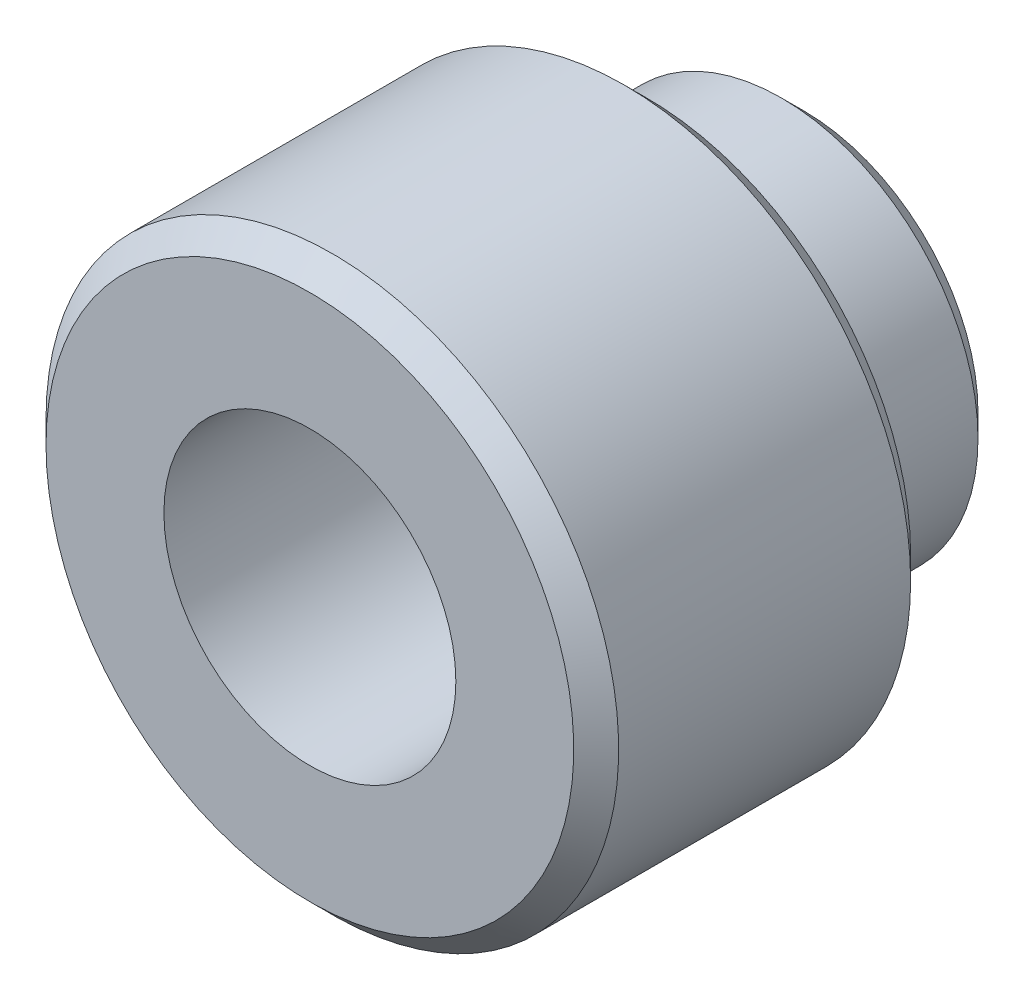
ISO-10303-21;
HEADER;
FILE_DESCRIPTION(('STEP AP214'),'2;1');
FILE_NAME('part.step','',(''),(''),'','','');
FILE_SCHEMA(('AUTOMOTIVE_DESIGN { 1 0 10303 214 1 1 1 1 }'));
ENDSEC;
DATA;
#1=APPLICATION_CONTEXT('core data for automotive mechanical design processes');
#2=APPLICATION_PROTOCOL_DEFINITION('international standard','automotive_design',2000,#1);
#3=PRODUCT_CONTEXT('',#1,'mechanical');
#4=PRODUCT('Part','Part','',(#3));
#5=PRODUCT_RELATED_PRODUCT_CATEGORY('part','',(#4));
#6=PRODUCT_DEFINITION_FORMATION('','',#4);
#7=PRODUCT_DEFINITION_CONTEXT('part definition',#1,'design');
#8=PRODUCT_DEFINITION('design','',#6,#7);
#9=PRODUCT_DEFINITION_SHAPE('','',#8);
#10=(LENGTH_UNIT() NAMED_UNIT(*) SI_UNIT(.MILLI.,.METRE.));
#11=(NAMED_UNIT(*) PLANE_ANGLE_UNIT() SI_UNIT($,.RADIAN.));
#12=(NAMED_UNIT(*) SI_UNIT($,.STERADIAN.) SOLID_ANGLE_UNIT());
#13=UNCERTAINTY_MEASURE_WITH_UNIT(LENGTH_MEASURE(1.E-05),#10,'distance_accuracy_value','');
#14=(GEOMETRIC_REPRESENTATION_CONTEXT(3) GLOBAL_UNCERTAINTY_ASSIGNED_CONTEXT((#13)) GLOBAL_UNIT_ASSIGNED_CONTEXT((#10,
#11,#12)) REPRESENTATION_CONTEXT('',''));
#15=CARTESIAN_POINT('',(0.,0.,0.));
#16=DIRECTION('',(0.,0.,1.));
#17=DIRECTION('',(1.,0.,0.));
#18=AXIS2_PLACEMENT_3D('',#15,#16,#17);
#19=CARTESIAN_POINT('',(48.418999999905,1.581000000095,0.6));
#20=DIRECTION('',(0.,0.,-1.));
#21=DIRECTION('',(-1.,0.,0.));
#22=AXIS2_PLACEMENT_3D('',#19,#20,#21);
#23=PLANE('',#22);
#24=CARTESIAN_POINT('',(50.,0.,0.60000000001991));
#25=DIRECTION('',(0.,0.,-1.));
#26=DIRECTION('',(0.,1.,0.));
#27=AXIS2_PLACEMENT_3D('',#24,#25,#26);
#28=CIRCLE('',#27,1.30079999997061);
#29=CARTESIAN_POINT('',(50.,1.30079999997061,0.600000000019917));
#30=VERTEX_POINT('',#29);
#31=EDGE_CURVE('E39',#30,#30,#28,.F.);
#32=ORIENTED_EDGE('',*,*,#31,.T.);
#33=EDGE_LOOP('',(#32));
#34=FACE_BOUND('',#33,.T.);
#35=CARTESIAN_POINT('',(50.,0.,0.599999999963108));
#36=DIRECTION('',(0.,0.,1.));
#37=DIRECTION('',(1.,0.,0.));
#38=AXIS2_PLACEMENT_3D('',#35,#36,#37);
#39=CIRCLE('',#38,1.55000000009009);
#40=CARTESIAN_POINT('',(51.5500000000901,0.,0.599999999963137));
#41=VERTEX_POINT('',#40);
#42=EDGE_CURVE('E18',#41,#41,#39,.T.);
#43=ORIENTED_EDGE('',*,*,#42,.F.);
#44=EDGE_LOOP('',(#43));
#45=FACE_BOUND('',#44,.T.);
#46=ADVANCED_FACE('F15',(#34,#45),#23,.T.);
#47=CARTESIAN_POINT('',(50.,0.,0.799999999969752));
#48=DIRECTION('',(0.,0.,1.));
#49=DIRECTION('',(1.,0.,0.));
#50=AXIS2_PLACEMENT_3D('',#47,#48,#49);
#51=CONICAL_SURFACE('',#50,1.74999999996073,0.785398163057437);
#52=ORIENTED_EDGE('',*,*,#42,.T.);
#53=EDGE_LOOP('',(#52));
#54=FACE_BOUND('',#53,.T.);
#55=CARTESIAN_POINT('',(50.,0.,0.800000000000207));
#56=DIRECTION('',(0.,0.,-1.));
#57=DIRECTION('',(-1.,0.,0.));
#58=AXIS2_PLACEMENT_3D('',#55,#56,#57);
#59=CIRCLE('',#58,1.75);
#60=CARTESIAN_POINT('',(48.25,0.,0.800000000000207));
#61=VERTEX_POINT('',#60);
#62=EDGE_CURVE('E36',#61,#61,#59,.F.);
#63=ORIENTED_EDGE('',*,*,#62,.F.);
#64=EDGE_LOOP('',(#63));
#65=FACE_BOUND('',#64,.T.);
#66=ADVANCED_FACE('F55',(#54,#65),#51,.T.);
#67=CARTESIAN_POINT('',(50.,0.,0.60000000001991));
#68=DIRECTION('',(0.,0.,-1.));
#69=DIRECTION('',(0.,1.,0.));
#70=AXIS2_PLACEMENT_3D('',#67,#68,#69);
#71=CONICAL_SURFACE('',#70,1.30079999997061,0.750491542910287);
#72=ORIENTED_EDGE('',*,*,#31,.F.);
#73=EDGE_LOOP('',(#72));
#74=FACE_BOUND('',#73,.T.);
#75=CARTESIAN_POINT('',(50.,0.,0.600857894968453));
#76=DIRECTION('',(0.,0.,-1.));
#77=DIRECTION('',(-1.,0.,0.));
#78=AXIS2_PLACEMENT_3D('',#75,#76,#77);
#79=CIRCLE('',#78,1.3);
#80=CARTESIAN_POINT('',(48.7,0.,0.600857894968453));
#81=VERTEX_POINT('',#80);
#82=EDGE_CURVE('E32',#81,#81,#79,.F.);
#83=ORIENTED_EDGE('',*,*,#82,.T.);
#84=EDGE_LOOP('',(#83));
#85=FACE_BOUND('',#84,.T.);
#86=ADVANCED_FACE('F63',(#74,#85),#71,.F.);
#87=CARTESIAN_POINT('',(50.,0.,0.448));
#88=DIRECTION('',(0.,0.,-1.));
#89=DIRECTION('',(-1.,0.,0.));
#90=AXIS2_PLACEMENT_3D('',#87,#88,#89);
#91=CYLINDRICAL_SURFACE('',#90,1.75);
#92=CARTESIAN_POINT('',(50.,0.,2.));
#93=DIRECTION('',(0.,0.,-1.));
#94=DIRECTION('',(-1.,0.,0.));
#95=AXIS2_PLACEMENT_3D('',#92,#93,#94);
#96=CIRCLE('',#95,1.75);
#97=CARTESIAN_POINT('',(48.25,0.,2.));
#98=VERTEX_POINT('',#97);
#99=EDGE_CURVE('E35',#98,#98,#96,.F.);
#100=ORIENTED_EDGE('',*,*,#99,.F.);
#101=EDGE_LOOP('',(#100));
#102=FACE_BOUND('',#101,.T.);
#103=ORIENTED_EDGE('',*,*,#62,.T.);
#104=EDGE_LOOP('',(#103));
#105=FACE_BOUND('',#104,.T.);
#106=ADVANCED_FACE('F90',(#102,#105),#91,.T.);
#107=CARTESIAN_POINT('',(50.,0.,7.));
#108=DIRECTION('',(0.,0.,-1.));
#109=DIRECTION('',(-1.,0.,0.));
#110=AXIS2_PLACEMENT_3D('',#107,#108,#109);
#111=CYLINDRICAL_SURFACE('',#110,1.3);
#112=ORIENTED_EDGE('',*,*,#82,.F.);
#113=EDGE_LOOP('',(#112));
#114=FACE_BOUND('',#113,.T.);
#115=CARTESIAN_POINT('',(50.,0.,5.));
#116=DIRECTION('',(0.,0.,-1.));
#117=DIRECTION('',(-1.,0.,0.));
#118=AXIS2_PLACEMENT_3D('',#115,#116,#117);
#119=CIRCLE('',#118,1.3);
#120=CARTESIAN_POINT('',(48.7,0.,5.));
#121=VERTEX_POINT('',#120);
#122=EDGE_CURVE('E45',#121,#121,#119,.T.);
#123=ORIENTED_EDGE('',*,*,#122,.F.);
#124=EDGE_LOOP('',(#123));
#125=FACE_BOUND('',#124,.T.);
#126=ADVANCED_FACE('F86',(#114,#125),#111,.F.);
#127=CARTESIAN_POINT('',(53.072,-3.072,2.));
#128=DIRECTION('',(0.,0.,-1.));
#129=DIRECTION('',(-1.,0.,0.));
#130=AXIS2_PLACEMENT_3D('',#127,#128,#129);
#131=PLANE('',#130);
#132=ORIENTED_EDGE('',*,*,#99,.T.);
#133=EDGE_LOOP('',(#132));
#134=FACE_BOUND('',#133,.T.);
#135=CARTESIAN_POINT('',(50.,0.,1.99999999995247));
#136=DIRECTION('',(0.,0.,1.));
#137=DIRECTION('',(1.,0.,0.));
#138=AXIS2_PLACEMENT_3D('',#135,#136,#137);
#139=CIRCLE('',#138,2.35000000012772);
#140=CARTESIAN_POINT('',(52.3500000001277,0.,1.99999999995229));
#141=VERTEX_POINT('',#140);
#142=EDGE_CURVE('E42',#141,#141,#139,.T.);
#143=ORIENTED_EDGE('',*,*,#142,.F.);
#144=EDGE_LOOP('',(#143));
#145=FACE_BOUND('',#144,.T.);
#146=ADVANCED_FACE('F82',(#134,#145),#131,.T.);
#147=CARTESIAN_POINT('',(47.602999999857,-2.397000000144,5.));
#148=DIRECTION('',(0.,0.,1.));
#149=DIRECTION('',(1.,0.,0.));
#150=AXIS2_PLACEMENT_3D('',#147,#148,#149);
#151=PLANE('',#150);
#152=ORIENTED_EDGE('',*,*,#122,.T.);
#153=EDGE_LOOP('',(#152));
#154=FACE_BOUND('',#153,.T.);
#155=CARTESIAN_POINT('',(50.,0.,4.99999999993861));
#156=DIRECTION('',(0.,0.,-1.));
#157=DIRECTION('',(-1.,0.,0.));
#158=AXIS2_PLACEMENT_3D('',#155,#156,#157);
#159=CIRCLE('',#158,2.35000000012688);
#160=CARTESIAN_POINT('',(47.6499999998731,0.,4.99999999993878));
#161=VERTEX_POINT('',#160);
#162=EDGE_CURVE('E27',#161,#161,#159,.T.);
#163=ORIENTED_EDGE('',*,*,#162,.F.);
#164=EDGE_LOOP('',(#163));
#165=FACE_BOUND('',#164,.T.);
#166=ADVANCED_FACE('F78',(#154,#165),#151,.T.);
#167=CARTESIAN_POINT('',(50.,0.,2.20000000001593));
#168=DIRECTION('',(0.,0.,1.));
#169=DIRECTION('',(1.,0.,0.));
#170=AXIS2_PLACEMENT_3D('',#167,#168,#169);
#171=CONICAL_SURFACE('',#170,2.55000000003142,0.785398162998035);
#172=ORIENTED_EDGE('',*,*,#142,.T.);
#173=EDGE_LOOP('',(#172));
#174=FACE_BOUND('',#173,.T.);
#175=CARTESIAN_POINT('',(50.,0.,2.2));
#176=DIRECTION('',(0.,0.,-1.));
#177=DIRECTION('',(-1.,0.,0.));
#178=AXIS2_PLACEMENT_3D('',#175,#176,#177);
#179=CIRCLE('',#178,2.55);
#180=CARTESIAN_POINT('',(47.45,0.,2.2));
#181=VERTEX_POINT('',#180);
#182=EDGE_CURVE('E22',#181,#181,#179,.F.);
#183=ORIENTED_EDGE('',*,*,#182,.F.);
#184=EDGE_LOOP('',(#183));
#185=FACE_BOUND('',#184,.T.);
#186=ADVANCED_FACE('F71',(#174,#185),#171,.T.);
#187=CARTESIAN_POINT('',(50.,0.,4.79999999998859));
#188=DIRECTION('',(0.,0.,-1.));
#189=DIRECTION('',(-1.,0.,0.));
#190=AXIS2_PLACEMENT_3D('',#187,#188,#189);
#191=CONICAL_SURFACE('',#190,2.54999999997783,0.785398163149783);
#192=ORIENTED_EDGE('',*,*,#162,.T.);
#193=EDGE_LOOP('',(#192));
#194=FACE_BOUND('',#193,.T.);
#195=CARTESIAN_POINT('',(50.,0.,4.8));
#196=DIRECTION('',(0.,0.,-1.));
#197=DIRECTION('',(-1.,0.,0.));
#198=AXIS2_PLACEMENT_3D('',#195,#196,#197);
#199=CIRCLE('',#198,2.55);
#200=CARTESIAN_POINT('',(47.45,0.,4.8));
#201=VERTEX_POINT('',#200);
#202=EDGE_CURVE('E10',#201,#201,#199,.T.);
#203=ORIENTED_EDGE('',*,*,#202,.F.);
#204=EDGE_LOOP('',(#203));
#205=FACE_BOUND('',#204,.T.);
#206=ADVANCED_FACE('F66',(#194,#205),#191,.T.);
#207=CARTESIAN_POINT('',(50.,0.,0.988));
#208=DIRECTION('',(0.,0.,-1.));
#209=DIRECTION('',(-1.,0.,0.));
#210=AXIS2_PLACEMENT_3D('',#207,#208,#209);
#211=CYLINDRICAL_SURFACE('',#210,2.55);
#212=ORIENTED_EDGE('',*,*,#202,.T.);
#213=EDGE_LOOP('',(#212));
#214=FACE_BOUND('',#213,.T.);
#215=ORIENTED_EDGE('',*,*,#182,.T.);
#216=EDGE_LOOP('',(#215));
#217=FACE_BOUND('',#216,.T.);
#218=ADVANCED_FACE('F64',(#214,#217),#211,.T.);
#219=CLOSED_SHELL('',(#46,#66,#86,#106,#126,#146,#166,#186,#206,#218));
#220=MANIFOLD_SOLID_BREP('B1',#219);
#221=ADVANCED_BREP_SHAPE_REPRESENTATION('',(#18,#220),#14);
#222=SHAPE_DEFINITION_REPRESENTATION(#9,#221);
ENDSEC;
END-ISO-10303-21;
